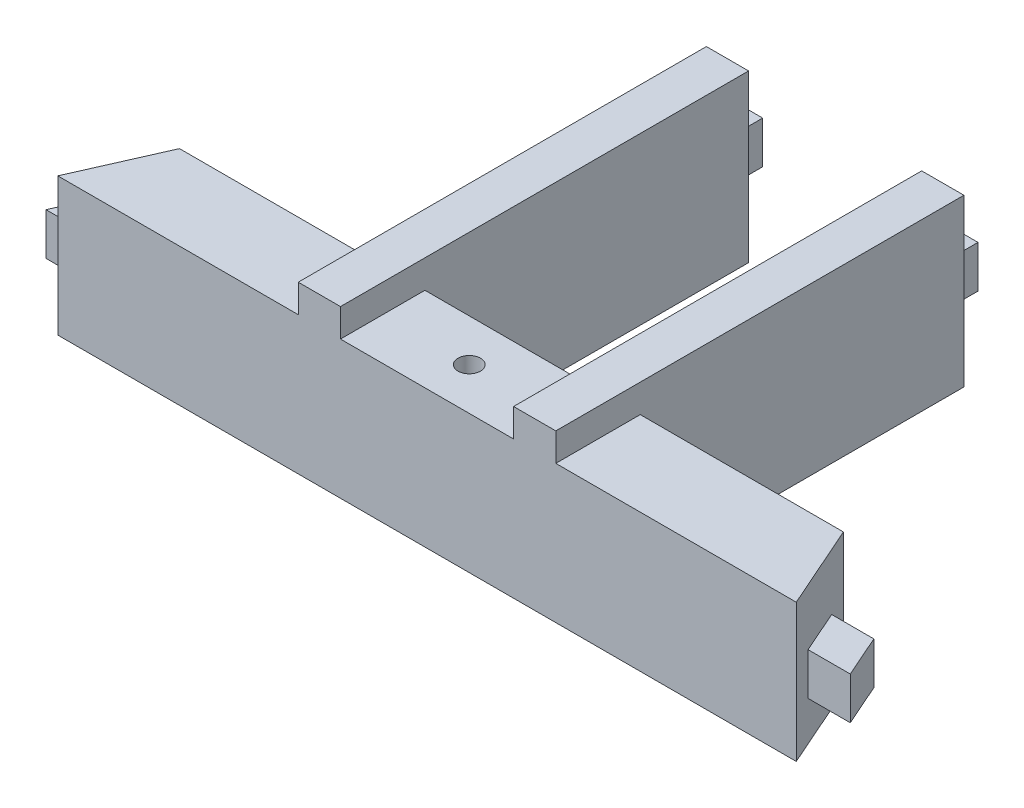
ISO-10303-21;
HEADER;
FILE_DESCRIPTION(('STEP AP214'),'2;1');
FILE_NAME('part.step','',(''),(''),'','','');
FILE_SCHEMA(('AUTOMOTIVE_DESIGN { 1 0 10303 214 1 1 1 1 }'));
ENDSEC;
DATA;
#1=APPLICATION_CONTEXT('core data for automotive mechanical design processes');
#2=APPLICATION_PROTOCOL_DEFINITION('international standard','automotive_design',2000,#1);
#3=PRODUCT_CONTEXT('',#1,'mechanical');
#4=PRODUCT('Part','Part','',(#3));
#5=PRODUCT_RELATED_PRODUCT_CATEGORY('part','',(#4));
#6=PRODUCT_DEFINITION_FORMATION('','',#4);
#7=PRODUCT_DEFINITION_CONTEXT('part definition',#1,'design');
#8=PRODUCT_DEFINITION('design','',#6,#7);
#9=PRODUCT_DEFINITION_SHAPE('','',#8);
#10=(LENGTH_UNIT() NAMED_UNIT(*) SI_UNIT(.MILLI.,.METRE.));
#11=(NAMED_UNIT(*) PLANE_ANGLE_UNIT() SI_UNIT($,.RADIAN.));
#12=(NAMED_UNIT(*) SI_UNIT($,.STERADIAN.) SOLID_ANGLE_UNIT());
#13=UNCERTAINTY_MEASURE_WITH_UNIT(LENGTH_MEASURE(1.E-05),#10,'distance_accuracy_value','');
#14=(GEOMETRIC_REPRESENTATION_CONTEXT(3) GLOBAL_UNCERTAINTY_ASSIGNED_CONTEXT((#13)) GLOBAL_UNIT_ASSIGNED_CONTEXT((#10,
#11,#12)) REPRESENTATION_CONTEXT('',''));
#15=CARTESIAN_POINT('',(0.,0.,0.));
#16=DIRECTION('',(0.,0.,1.));
#17=DIRECTION('',(1.,0.,0.));
#18=AXIS2_PLACEMENT_3D('',#15,#16,#17);
#19=CARTESIAN_POINT('',(-8.,23.,-72.5));
#20=DIRECTION('',(0.,0.,1.));
#21=DIRECTION('',(1.,0.,0.));
#22=AXIS2_PLACEMENT_3D('',#19,#20,#21);
#23=PLANE('',#22);
#24=DIRECTION('',(0.,1.,0.));
#25=VECTOR('',#24,1.);
#26=CARTESIAN_POINT('',(-9.15,-39.75283638214,-72.5));
#27=LINE('',#26,#25);
#28=CARTESIAN_POINT('',(-9.15,20.2,-72.5));
#29=VERTEX_POINT('',#28);
#30=CARTESIAN_POINT('',(-9.15,32.,-72.5));
#31=VERTEX_POINT('',#30);
#32=EDGE_CURVE('E576',#29,#31,#27,.T.);
#33=ORIENTED_EDGE('',*,*,#32,.T.);
#34=DIRECTION('',(1.,0.,0.));
#35=VECTOR('',#34,1.);
#36=CARTESIAN_POINT('',(13.4420338202135,32.,-72.5));
#37=LINE('',#36,#35);
#38=CARTESIAN_POINT('',(-6.15,32.,-72.5));
#39=VERTEX_POINT('',#38);
#40=EDGE_CURVE('E474',#31,#39,#37,.T.);
#41=ORIENTED_EDGE('',*,*,#40,.T.);
#42=DIRECTION('',(0.,1.,0.));
#43=VECTOR('',#42,1.);
#44=CARTESIAN_POINT('',(-6.15,-39.75283638214,-72.5));
#45=LINE('',#44,#43);
#46=CARTESIAN_POINT('',(-6.15,20.2,-72.5));
#47=VERTEX_POINT('',#46);
#48=EDGE_CURVE('E574',#47,#39,#45,.T.);
#49=ORIENTED_EDGE('',*,*,#48,.F.);
#50=DIRECTION('',(1.,0.,0.));
#51=VECTOR('',#50,1.);
#52=CARTESIAN_POINT('',(0.,20.2,-72.5));
#53=LINE('',#52,#51);
#54=EDGE_CURVE('E532',#29,#47,#53,.T.);
#55=ORIENTED_EDGE('',*,*,#54,.F.);
#56=EDGE_LOOP('',(#33,#41,#49,#55));
#57=FACE_BOUND('',#56,.T.);
#58=DIRECTION('',(0.,1.,0.));
#59=VECTOR('',#58,1.);
#60=CARTESIAN_POINT('',(-8.15,27.6,-72.5));
#61=LINE('',#60,#59);
#62=CARTESIAN_POINT('',(-8.15,24.6,-72.5));
#63=VERTEX_POINT('',#62);
#64=CARTESIAN_POINT('',(-8.15,27.6,-72.5));
#65=VERTEX_POINT('',#64);
#66=EDGE_CURVE('E372',#63,#65,#61,.T.);
#67=ORIENTED_EDGE('',*,*,#66,.F.);
#68=DIRECTION('',(-1.,0.,0.));
#69=VECTOR('',#68,1.);
#70=CARTESIAN_POINT('',(-8.15,24.6,-72.5));
#71=LINE('',#70,#69);
#72=CARTESIAN_POINT('',(-7.15,24.6,-72.5));
#73=VERTEX_POINT('',#72);
#74=EDGE_CURVE('E369',#73,#63,#71,.T.);
#75=ORIENTED_EDGE('',*,*,#74,.F.);
#76=DIRECTION('',(0.,-1.,0.));
#77=VECTOR('',#76,1.);
#78=CARTESIAN_POINT('',(-7.15,27.6,-72.5));
#79=LINE('',#78,#77);
#80=CARTESIAN_POINT('',(-7.15,27.6,-72.5));
#81=VERTEX_POINT('',#80);
#82=EDGE_CURVE('E164',#81,#73,#79,.T.);
#83=ORIENTED_EDGE('',*,*,#82,.F.);
#84=DIRECTION('',(1.,0.,0.));
#85=VECTOR('',#84,1.);
#86=CARTESIAN_POINT('',(-8.15,27.6,-72.5));
#87=LINE('',#86,#85);
#88=EDGE_CURVE('E159',#65,#81,#87,.T.);
#89=ORIENTED_EDGE('',*,*,#88,.F.);
#90=EDGE_LOOP('',(#67,#75,#83,#89));
#91=FACE_BOUND('',#90,.T.);
#92=ADVANCED_FACE('F144',(#57,#91),#23,.F.);
#93=CARTESIAN_POINT('',(1.84883014201315E-13,23.,-72.5));
#94=DIRECTION('',(0.,0.,-1.));
#95=DIRECTION('',(-1.,0.,0.));
#96=AXIS2_PLACEMENT_3D('',#93,#94,#95);
#97=PLANE('',#96);
#98=CARTESIAN_POINT('',(6.15,32.,-72.5));
#99=VERTEX_POINT('',#98);
#100=CARTESIAN_POINT('',(9.15000000000001,32.,-72.5));
#101=VERTEX_POINT('',#100);
#102=EDGE_CURVE('E465',#99,#101,#37,.T.);
#103=ORIENTED_EDGE('',*,*,#102,.T.);
#104=DIRECTION('',(0.,1.,0.));
#105=VECTOR('',#104,1.);
#106=CARTESIAN_POINT('',(9.15,-39.75283638214,-72.5));
#107=LINE('',#106,#105);
#108=CARTESIAN_POINT('',(9.15,20.2,-72.5));
#109=VERTEX_POINT('',#108);
#110=EDGE_CURVE('E565',#109,#101,#107,.T.);
#111=ORIENTED_EDGE('',*,*,#110,.F.);
#112=DIRECTION('',(1.,0.,0.));
#113=VECTOR('',#112,1.);
#114=CARTESIAN_POINT('',(0.,20.2,-72.5));
#115=LINE('',#114,#113);
#116=CARTESIAN_POINT('',(6.15,20.2,-72.5));
#117=VERTEX_POINT('',#116);
#118=EDGE_CURVE('E13',#117,#109,#115,.T.);
#119=ORIENTED_EDGE('',*,*,#118,.F.);
#120=DIRECTION('',(0.,1.,0.));
#121=VECTOR('',#120,1.);
#122=CARTESIAN_POINT('',(6.15,-39.75283638214,-72.5));
#123=LINE('',#122,#121);
#124=EDGE_CURVE('E567',#117,#99,#123,.T.);
#125=ORIENTED_EDGE('',*,*,#124,.T.);
#126=EDGE_LOOP('',(#103,#111,#119,#125));
#127=FACE_BOUND('',#126,.T.);
#128=DIRECTION('',(1.,0.,0.));
#129=VECTOR('',#128,1.);
#130=CARTESIAN_POINT('',(8.15,27.6,-72.5));
#131=LINE('',#130,#129);
#132=CARTESIAN_POINT('',(7.15,27.6,-72.5));
#133=VERTEX_POINT('',#132);
#134=CARTESIAN_POINT('',(8.15,27.6,-72.5));
#135=VERTEX_POINT('',#134);
#136=EDGE_CURVE('E376',#133,#135,#131,.T.);
#137=ORIENTED_EDGE('',*,*,#136,.F.);
#138=DIRECTION('',(0.,1.,0.));
#139=VECTOR('',#138,1.);
#140=CARTESIAN_POINT('',(7.15,27.6,-72.5));
#141=LINE('',#140,#139);
#142=CARTESIAN_POINT('',(7.15,24.6,-72.5));
#143=VERTEX_POINT('',#142);
#144=EDGE_CURVE('E373',#143,#133,#141,.T.);
#145=ORIENTED_EDGE('',*,*,#144,.F.);
#146=DIRECTION('',(-1.,0.,0.));
#147=VECTOR('',#146,1.);
#148=CARTESIAN_POINT('',(8.15,24.6,-72.5));
#149=LINE('',#148,#147);
#150=CARTESIAN_POINT('',(8.15,24.6,-72.5));
#151=VERTEX_POINT('',#150);
#152=EDGE_CURVE('E386',#151,#143,#149,.T.);
#153=ORIENTED_EDGE('',*,*,#152,.F.);
#154=DIRECTION('',(0.,-1.,0.));
#155=VECTOR('',#154,1.);
#156=CARTESIAN_POINT('',(8.15,27.6,-72.5));
#157=LINE('',#156,#155);
#158=EDGE_CURVE('E394',#135,#151,#157,.T.);
#159=ORIENTED_EDGE('',*,*,#158,.F.);
#160=EDGE_LOOP('',(#137,#145,#153,#159));
#161=FACE_BOUND('',#160,.T.);
#162=ADVANCED_FACE('F614',(#127,#161),#97,.T.);
#163=CARTESIAN_POINT('',(-13.4420338202134,23.,-72.5));
#164=DIRECTION('',(0.914917801572932,0.,0.403640206576294));
#165=DIRECTION('',(0.403640206576294,0.,-0.914917801572932));
#166=AXIS2_PLACEMENT_3D('',#163,#164,#165);
#167=PLANE('',#166);
#168=DIRECTION('',(0.,1.,0.));
#169=VECTOR('',#168,1.);
#170=CARTESIAN_POINT('',(-26.2361514672722,-39.75283638214,-43.5));
#171=LINE('',#170,#169);
#172=CARTESIAN_POINT('',(-26.2361514672722,20.2,-43.5));
#173=VERTEX_POINT('',#172);
#174=CARTESIAN_POINT('',(-26.2361514672722,30.,-43.5));
#175=VERTEX_POINT('',#174);
#176=EDGE_CURVE('E583',#173,#175,#171,.T.);
#177=ORIENTED_EDGE('',*,*,#176,.T.);
#178=DIRECTION('',(-0.403640206576294,0.,0.914917801572932));
#179=VECTOR('',#178,1.);
#180=CARTESIAN_POINT('',(-38.0260616192373,30.,-16.7762036555459));
#181=LINE('',#180,#179);
#182=CARTESIAN_POINT('',(-23.5890926437428,30.,-49.5));
#183=VERTEX_POINT('',#182);
#184=EDGE_CURVE('E478',#183,#175,#181,.T.);
#185=ORIENTED_EDGE('',*,*,#184,.F.);
#186=DIRECTION('',(0.,1.,0.));
#187=VECTOR('',#186,1.);
#188=CARTESIAN_POINT('',(-23.5890926437428,-39.75283638214,-49.5));
#189=LINE('',#188,#187);
#190=CARTESIAN_POINT('',(-23.5890926437428,20.2,-49.5));
#191=VERTEX_POINT('',#190);
#192=EDGE_CURVE('E581',#191,#183,#189,.T.);
#193=ORIENTED_EDGE('',*,*,#192,.F.);
#194=DIRECTION('',(0.403640206576293,0.,-0.914917801572932));
#195=VECTOR('',#194,1.);
#196=CARTESIAN_POINT('',(-38.0260616192373,20.2,-16.7762036555459));
#197=LINE('',#196,#195);
#198=EDGE_CURVE('E540',#173,#191,#197,.T.);
#199=ORIENTED_EDGE('',*,*,#198,.F.);
#200=EDGE_LOOP('',(#177,#185,#193,#199));
#201=FACE_BOUND('',#200,.T.);
#202=DIRECTION('',(-0.403640206576294,0.,0.914917801572932));
#203=VECTOR('',#202,1.);
#204=CARTESIAN_POINT('',(-25.5743867613899,23.,-45.));
#205=LINE('',#204,#203);
#206=CARTESIAN_POINT('',(-24.2508573496252,23.,-48.));
#207=VERTEX_POINT('',#206);
#208=CARTESIAN_POINT('',(-25.5743867613899,23.,-45.));
#209=VERTEX_POINT('',#208);
#210=EDGE_CURVE('E433',#207,#209,#205,.T.);
#211=ORIENTED_EDGE('',*,*,#210,.F.);
#212=DIRECTION('',(0.,-1.,0.));
#213=VECTOR('',#212,1.);
#214=CARTESIAN_POINT('',(-24.2508573496252,26.,-48.));
#215=LINE('',#214,#213);
#216=CARTESIAN_POINT('',(-24.2508573496252,26.,-48.));
#217=VERTEX_POINT('',#216);
#218=EDGE_CURVE('E463',#217,#207,#215,.T.);
#219=ORIENTED_EDGE('',*,*,#218,.F.);
#220=DIRECTION('',(-0.403640206576294,0.,0.914917801572932));
#221=VECTOR('',#220,1.);
#222=CARTESIAN_POINT('',(-25.5743867613899,26.,-45.));
#223=LINE('',#222,#221);
#224=CARTESIAN_POINT('',(-25.5743867613899,26.,-45.));
#225=VERTEX_POINT('',#224);
#226=EDGE_CURVE('E440',#217,#225,#223,.T.);
#227=ORIENTED_EDGE('',*,*,#226,.T.);
#228=DIRECTION('',(0.,-1.,0.));
#229=VECTOR('',#228,1.);
#230=CARTESIAN_POINT('',(-25.5743867613899,26.,-45.));
#231=LINE('',#230,#229);
#232=EDGE_CURVE('E453',#225,#209,#231,.T.);
#233=ORIENTED_EDGE('',*,*,#232,.T.);
#234=EDGE_LOOP('',(#211,#219,#227,#233));
#235=FACE_BOUND('',#234,.T.);
#236=ADVANCED_FACE('F654',(#201,#235),#167,.F.);
#237=CARTESIAN_POINT('',(0.,30.,0.));
#238=DIRECTION('',(0.,1.,0.));
#239=DIRECTION('',(0.,0.,1.));
#240=AXIS2_PLACEMENT_3D('',#237,#238,#239);
#241=PLANE('',#240);
#242=DIRECTION('',(1.,0.,0.));
#243=VECTOR('',#242,1.);
#244=CARTESIAN_POINT('',(0.,30.,-49.5));
#245=LINE('',#244,#243);
#246=CARTESIAN_POINT('',(-9.15,30.,-49.5));
#247=VERTEX_POINT('',#246);
#248=EDGE_CURVE('E558',#183,#247,#245,.T.);
#249=ORIENTED_EDGE('',*,*,#248,.F.);
#250=ORIENTED_EDGE('',*,*,#184,.T.);
#251=DIRECTION('',(1.,0.,0.));
#252=VECTOR('',#251,1.);
#253=CARTESIAN_POINT('',(0.,30.,-43.5));
#254=LINE('',#253,#252);
#255=CARTESIAN_POINT('',(-9.15,30.,-43.5));
#256=VERTEX_POINT('',#255);
#257=EDGE_CURVE('E556',#175,#256,#254,.T.);
#258=ORIENTED_EDGE('',*,*,#257,.T.);
#259=DIRECTION('',(0.,0.,1.));
#260=VECTOR('',#259,1.);
#261=CARTESIAN_POINT('',(-9.15,30.,-78.5));
#262=LINE('',#261,#260);
#263=EDGE_CURVE('E502',#247,#256,#262,.T.);
#264=ORIENTED_EDGE('',*,*,#263,.F.);
#265=EDGE_LOOP('',(#249,#250,#258,#264));
#266=FACE_BOUND('',#265,.T.);
#267=ADVANCED_FACE('F651',(#266),#241,.T.);
#268=CARTESIAN_POINT('',(9.15000000000001,30.,-43.5));
#269=VERTEX_POINT('',#268);
#270=CARTESIAN_POINT('',(26.2361514672722,30.,-43.5));
#271=VERTEX_POINT('',#270);
#272=EDGE_CURVE('E555',#269,#271,#254,.T.);
#273=ORIENTED_EDGE('',*,*,#272,.T.);
#274=DIRECTION('',(-0.403640206576291,0.,-0.914917801572933));
#275=VECTOR('',#274,1.);
#276=CARTESIAN_POINT('',(38.0260616192373,30.,-16.7762036555457));
#277=LINE('',#276,#275);
#278=CARTESIAN_POINT('',(23.5890926437428,30.,-49.5));
#279=VERTEX_POINT('',#278);
#280=EDGE_CURVE('E475',#271,#279,#277,.T.);
#281=ORIENTED_EDGE('',*,*,#280,.T.);
#282=DIRECTION('',(1.,0.,0.));
#283=VECTOR('',#282,1.);
#284=CARTESIAN_POINT('',(0.,30.,-49.5));
#285=LINE('',#284,#283);
#286=CARTESIAN_POINT('',(9.15000000000001,30.,-49.5));
#287=VERTEX_POINT('',#286);
#288=EDGE_CURVE('E522',#287,#279,#285,.T.);
#289=ORIENTED_EDGE('',*,*,#288,.F.);
#290=DIRECTION('',(0.,0.,-1.));
#291=VECTOR('',#290,1.);
#292=CARTESIAN_POINT('',(9.15,30.,-78.5));
#293=LINE('',#292,#291);
#294=EDGE_CURVE('E485',#269,#287,#293,.T.);
#295=ORIENTED_EDGE('',*,*,#294,.F.);
#296=EDGE_LOOP('',(#273,#281,#289,#295));
#297=FACE_BOUND('',#296,.T.);
#298=ADVANCED_FACE('F600',(#297),#241,.T.);
#299=CARTESIAN_POINT('',(9.15000000000001,-39.75283638214,0.));
#300=DIRECTION('',(1.,0.,0.));
#301=DIRECTION('',(0.,0.,-1.));
#302=AXIS2_PLACEMENT_3D('',#299,#300,#301);
#303=PLANE('',#302);
#304=ORIENTED_EDGE('',*,*,#110,.T.);
#305=DIRECTION('',(0.,0.,-1.));
#306=VECTOR('',#305,1.);
#307=CARTESIAN_POINT('',(9.15,32.,-78.5));
#308=LINE('',#307,#306);
#309=CARTESIAN_POINT('',(9.15000000000001,32.,-43.5));
#310=VERTEX_POINT('',#309);
#311=EDGE_CURVE('E487',#310,#101,#308,.T.);
#312=ORIENTED_EDGE('',*,*,#311,.F.);
#313=DIRECTION('',(0.,-1.,0.));
#314=VECTOR('',#313,1.);
#315=CARTESIAN_POINT('',(9.15000000000001,32.,-43.5));
#316=LINE('',#315,#314);
#317=EDGE_CURVE('E490',#310,#269,#316,.T.);
#318=ORIENTED_EDGE('',*,*,#317,.T.);
#319=ORIENTED_EDGE('',*,*,#294,.T.);
#320=DIRECTION('',(0.,1.,0.));
#321=VECTOR('',#320,1.);
#322=CARTESIAN_POINT('',(9.15,-39.75283638214,-49.5));
#323=LINE('',#322,#321);
#324=CARTESIAN_POINT('',(9.15,20.2,-49.5));
#325=VERTEX_POINT('',#324);
#326=EDGE_CURVE('E527',#325,#287,#323,.T.);
#327=ORIENTED_EDGE('',*,*,#326,.F.);
#328=DIRECTION('',(0.,0.,1.));
#329=VECTOR('',#328,1.);
#330=CARTESIAN_POINT('',(9.15000000000001,20.2,0.));
#331=LINE('',#330,#329);
#332=EDGE_CURVE('E152',#109,#325,#331,.T.);
#333=ORIENTED_EDGE('',*,*,#332,.F.);
#334=EDGE_LOOP('',(#304,#312,#318,#319,#327,#333));
#335=FACE_BOUND('',#334,.T.);
#336=ADVANCED_FACE('F610',(#335),#303,.T.);
#337=CARTESIAN_POINT('',(-9.15000000000001,-39.75283638214,0.));
#338=DIRECTION('',(1.,0.,0.));
#339=DIRECTION('',(0.,0.,-1.));
#340=AXIS2_PLACEMENT_3D('',#337,#338,#339);
#341=PLANE('',#340);
#342=DIRECTION('',(0.,0.,1.));
#343=VECTOR('',#342,1.);
#344=CARTESIAN_POINT('',(-9.15,32.,-78.5));
#345=LINE('',#344,#343);
#346=CARTESIAN_POINT('',(-9.15,32.,-43.5));
#347=VERTEX_POINT('',#346);
#348=EDGE_CURVE('E501',#31,#347,#345,.T.);
#349=ORIENTED_EDGE('',*,*,#348,.F.);
#350=ORIENTED_EDGE('',*,*,#32,.F.);
#351=DIRECTION('',(0.,0.,1.));
#352=VECTOR('',#351,1.);
#353=CARTESIAN_POINT('',(-9.15000000000001,20.2,0.));
#354=LINE('',#353,#352);
#355=CARTESIAN_POINT('',(-9.15,20.2,-49.5));
#356=VERTEX_POINT('',#355);
#357=EDGE_CURVE('E534',#29,#356,#354,.T.);
#358=ORIENTED_EDGE('',*,*,#357,.T.);
#359=DIRECTION('',(0.,1.,0.));
#360=VECTOR('',#359,1.);
#361=CARTESIAN_POINT('',(-9.15,-39.75283638214,-49.5));
#362=LINE('',#361,#360);
#363=EDGE_CURVE('E578',#356,#247,#362,.T.);
#364=ORIENTED_EDGE('',*,*,#363,.T.);
#365=ORIENTED_EDGE('',*,*,#263,.T.);
#366=DIRECTION('',(0.,-1.,0.));
#367=VECTOR('',#366,1.);
#368=CARTESIAN_POINT('',(-9.15,32.,-43.5));
#369=LINE('',#368,#367);
#370=EDGE_CURVE('E513',#347,#256,#369,.T.);
#371=ORIENTED_EDGE('',*,*,#370,.F.);
#372=EDGE_LOOP('',(#349,#350,#358,#364,#365,#371));
#373=FACE_BOUND('',#372,.T.);
#374=ADVANCED_FACE('F646',(#373),#341,.F.);
#375=CARTESIAN_POINT('',(-6.15,-39.75283638214,0.));
#376=DIRECTION('',(1.,0.,0.));
#377=DIRECTION('',(0.,0.,-1.));
#378=AXIS2_PLACEMENT_3D('',#375,#376,#377);
#379=PLANE('',#378);
#380=ORIENTED_EDGE('',*,*,#48,.T.);
#381=DIRECTION('',(0.,0.,-1.));
#382=VECTOR('',#381,1.);
#383=CARTESIAN_POINT('',(-6.15,32.,-78.5));
#384=LINE('',#383,#382);
#385=CARTESIAN_POINT('',(-6.15,32.,-43.5));
#386=VERTEX_POINT('',#385);
#387=EDGE_CURVE('E498',#386,#39,#384,.T.);
#388=ORIENTED_EDGE('',*,*,#387,.F.);
#389=DIRECTION('',(0.,-1.,0.));
#390=VECTOR('',#389,1.);
#391=CARTESIAN_POINT('',(-6.15,32.,-43.5));
#392=LINE('',#391,#390);
#393=CARTESIAN_POINT('',(-6.15,30.,-43.5));
#394=VERTEX_POINT('',#393);
#395=EDGE_CURVE('E506',#386,#394,#392,.T.);
#396=ORIENTED_EDGE('',*,*,#395,.T.);
#397=DIRECTION('',(0.,0.,-1.));
#398=VECTOR('',#397,1.);
#399=CARTESIAN_POINT('',(-6.15,30.,-78.5));
#400=LINE('',#399,#398);
#401=CARTESIAN_POINT('',(-6.15,30.,-49.5));
#402=VERTEX_POINT('',#401);
#403=EDGE_CURVE('E497',#394,#402,#400,.T.);
#404=ORIENTED_EDGE('',*,*,#403,.T.);
#405=DIRECTION('',(0.,1.,0.));
#406=VECTOR('',#405,1.);
#407=CARTESIAN_POINT('',(-6.15,-39.75283638214,-49.5));
#408=LINE('',#407,#406);
#409=CARTESIAN_POINT('',(-6.15,20.2,-49.5));
#410=VERTEX_POINT('',#409);
#411=EDGE_CURVE('E572',#410,#402,#408,.T.);
#412=ORIENTED_EDGE('',*,*,#411,.F.);
#413=DIRECTION('',(0.,0.,1.));
#414=VECTOR('',#413,1.);
#415=CARTESIAN_POINT('',(-6.15,20.2,0.));
#416=LINE('',#415,#414);
#417=EDGE_CURVE('E530',#47,#410,#416,.T.);
#418=ORIENTED_EDGE('',*,*,#417,.F.);
#419=EDGE_LOOP('',(#380,#388,#396,#404,#412,#418));
#420=FACE_BOUND('',#419,.T.);
#421=ADVANCED_FACE('F633',(#420),#379,.T.);
#422=CARTESIAN_POINT('',(6.15,-39.75283638214,0.));
#423=DIRECTION('',(1.,0.,0.));
#424=DIRECTION('',(0.,0.,-1.));
#425=AXIS2_PLACEMENT_3D('',#422,#423,#424);
#426=PLANE('',#425);
#427=DIRECTION('',(0.,0.,1.));
#428=VECTOR('',#427,1.);
#429=CARTESIAN_POINT('',(6.15,32.,-78.5));
#430=LINE('',#429,#428);
#431=CARTESIAN_POINT('',(6.15,32.,-43.5));
#432=VERTEX_POINT('',#431);
#433=EDGE_CURVE('E482',#99,#432,#430,.T.);
#434=ORIENTED_EDGE('',*,*,#433,.F.);
#435=ORIENTED_EDGE('',*,*,#124,.F.);
#436=DIRECTION('',(0.,0.,1.));
#437=VECTOR('',#436,1.);
#438=CARTESIAN_POINT('',(6.15,20.2,0.));
#439=LINE('',#438,#437);
#440=CARTESIAN_POINT('',(6.15,20.2,-49.5));
#441=VERTEX_POINT('',#440);
#442=EDGE_CURVE('E523',#117,#441,#439,.T.);
#443=ORIENTED_EDGE('',*,*,#442,.T.);
#444=DIRECTION('',(0.,1.,0.));
#445=VECTOR('',#444,1.);
#446=CARTESIAN_POINT('',(6.15,-39.75283638214,-49.5));
#447=LINE('',#446,#445);
#448=CARTESIAN_POINT('',(6.15,30.,-49.5));
#449=VERTEX_POINT('',#448);
#450=EDGE_CURVE('E569',#441,#449,#447,.T.);
#451=ORIENTED_EDGE('',*,*,#450,.T.);
#452=DIRECTION('',(0.,0.,1.));
#453=VECTOR('',#452,1.);
#454=CARTESIAN_POINT('',(6.15,30.,-78.5));
#455=LINE('',#454,#453);
#456=CARTESIAN_POINT('',(6.15,30.,-43.5));
#457=VERTEX_POINT('',#456);
#458=EDGE_CURVE('E481',#449,#457,#455,.T.);
#459=ORIENTED_EDGE('',*,*,#458,.T.);
#460=DIRECTION('',(0.,-1.,0.));
#461=VECTOR('',#460,1.);
#462=CARTESIAN_POINT('',(6.15,32.,-43.5));
#463=LINE('',#462,#461);
#464=EDGE_CURVE('E494',#432,#457,#463,.T.);
#465=ORIENTED_EDGE('',*,*,#464,.F.);
#466=EDGE_LOOP('',(#434,#435,#443,#451,#459,#465));
#467=FACE_BOUND('',#466,.T.);
#468=ADVANCED_FACE('F694',(#467),#426,.F.);
#469=CARTESIAN_POINT('',(0.,32.,0.));
#470=DIRECTION('',(0.,-1.,0.));
#471=DIRECTION('',(0.,0.,-1.));
#472=AXIS2_PLACEMENT_3D('',#469,#470,#471);
#473=PLANE('',#472);
#474=ORIENTED_EDGE('',*,*,#40,.F.);
#475=ORIENTED_EDGE('',*,*,#348,.T.);
#476=DIRECTION('',(1.,0.,0.));
#477=VECTOR('',#476,1.);
#478=CARTESIAN_POINT('',(-6.15,32.,-43.5));
#479=LINE('',#478,#477);
#480=EDGE_CURVE('E504',#347,#386,#479,.T.);
#481=ORIENTED_EDGE('',*,*,#480,.T.);
#482=ORIENTED_EDGE('',*,*,#387,.T.);
#483=EDGE_LOOP('',(#474,#475,#481,#482));
#484=FACE_BOUND('',#483,.T.);
#485=ADVANCED_FACE('F640',(#484),#473,.F.);
#486=CARTESIAN_POINT('',(0.,32.,0.));
#487=DIRECTION('',(0.,1.,0.));
#488=DIRECTION('',(0.,0.,1.));
#489=AXIS2_PLACEMENT_3D('',#486,#487,#488);
#490=PLANE('',#489);
#491=ORIENTED_EDGE('',*,*,#311,.T.);
#492=ORIENTED_EDGE('',*,*,#102,.F.);
#493=ORIENTED_EDGE('',*,*,#433,.T.);
#494=DIRECTION('',(1.,0.,0.));
#495=VECTOR('',#494,1.);
#496=CARTESIAN_POINT('',(6.15,32.,-43.5));
#497=LINE('',#496,#495);
#498=EDGE_CURVE('E484',#432,#310,#497,.T.);
#499=ORIENTED_EDGE('',*,*,#498,.T.);
#500=EDGE_LOOP('',(#491,#492,#493,#499));
#501=FACE_BOUND('',#500,.T.);
#502=ADVANCED_FACE('F619',(#501),#490,.T.);
#503=CARTESIAN_POINT('',(0.,30.,-46.5000000000032));
#504=DIRECTION('',(0.,1.,0.));
#505=DIRECTION('',(0.,0.,1.));
#506=AXIS2_PLACEMENT_3D('',#503,#504,#505);
#507=CIRCLE('',#506,0.800000000000938);
#508=CARTESIAN_POINT('',(0.,30.,-45.7000000000023));
#509=VERTEX_POINT('',#508);
#510=EDGE_CURVE('E519',#509,#509,#507,.T.);
#511=ORIENTED_EDGE('',*,*,#510,.F.);
#512=EDGE_LOOP('',(#511));
#513=FACE_BOUND('',#512,.T.);
#514=EDGE_CURVE('E559',#394,#457,#254,.T.);
#515=ORIENTED_EDGE('',*,*,#514,.T.);
#516=ORIENTED_EDGE('',*,*,#458,.F.);
#517=DIRECTION('',(1.,0.,0.));
#518=VECTOR('',#517,1.);
#519=CARTESIAN_POINT('',(0.,30.,-49.5));
#520=LINE('',#519,#518);
#521=EDGE_CURVE('E562',#402,#449,#520,.T.);
#522=ORIENTED_EDGE('',*,*,#521,.F.);
#523=ORIENTED_EDGE('',*,*,#403,.F.);
#524=EDGE_LOOP('',(#515,#516,#522,#523));
#525=FACE_BOUND('',#524,.T.);
#526=ADVANCED_FACE('F146',(#513,#525),#241,.T.);
#527=CARTESIAN_POINT('',(0.,-39.75283638214,-49.5));
#528=DIRECTION('',(0.,0.,1.));
#529=DIRECTION('',(1.,0.,0.));
#530=AXIS2_PLACEMENT_3D('',#527,#528,#529);
#531=PLANE('',#530);
#532=DIRECTION('',(0.,1.,0.));
#533=VECTOR('',#532,1.);
#534=CARTESIAN_POINT('',(23.5890929023814,-39.75283638214,-49.5));
#535=LINE('',#534,#533);
#536=CARTESIAN_POINT('',(23.5890926437428,20.2,-49.5));
#537=VERTEX_POINT('',#536);
#538=EDGE_CURVE('E587',#537,#279,#535,.T.);
#539=ORIENTED_EDGE('',*,*,#538,.F.);
#540=DIRECTION('',(-1.,0.,0.));
#541=VECTOR('',#540,1.);
#542=CARTESIAN_POINT('',(0.,20.2,-49.5));
#543=LINE('',#542,#541);
#544=EDGE_CURVE('E549',#537,#325,#543,.T.);
#545=ORIENTED_EDGE('',*,*,#544,.T.);
#546=ORIENTED_EDGE('',*,*,#326,.T.);
#547=ORIENTED_EDGE('',*,*,#288,.T.);
#548=EDGE_LOOP('',(#539,#545,#546,#547));
#549=FACE_BOUND('',#548,.T.);
#550=ADVANCED_FACE('F593',(#549),#531,.F.);
#551=CARTESIAN_POINT('',(0.,-39.75283638214,-43.5));
#552=DIRECTION('',(0.,0.,1.));
#553=DIRECTION('',(1.,0.,0.));
#554=AXIS2_PLACEMENT_3D('',#551,#552,#553);
#555=PLANE('',#554);
#556=DIRECTION('',(-1.,0.,0.));
#557=VECTOR('',#556,1.);
#558=CARTESIAN_POINT('',(0.,20.2,-43.5));
#559=LINE('',#558,#557);
#560=CARTESIAN_POINT('',(26.2361514672722,20.2,-43.5));
#561=VERTEX_POINT('',#560);
#562=EDGE_CURVE('E543',#561,#173,#559,.T.);
#563=ORIENTED_EDGE('',*,*,#562,.F.);
#564=DIRECTION('',(0.,1.,0.));
#565=VECTOR('',#564,1.);
#566=CARTESIAN_POINT('',(26.236151610291,-39.75283638214,-43.5));
#567=LINE('',#566,#565);
#568=EDGE_CURVE('E585',#561,#271,#567,.T.);
#569=ORIENTED_EDGE('',*,*,#568,.T.);
#570=ORIENTED_EDGE('',*,*,#272,.F.);
#571=ORIENTED_EDGE('',*,*,#317,.F.);
#572=ORIENTED_EDGE('',*,*,#498,.F.);
#573=ORIENTED_EDGE('',*,*,#464,.T.);
#574=ORIENTED_EDGE('',*,*,#514,.F.);
#575=ORIENTED_EDGE('',*,*,#395,.F.);
#576=ORIENTED_EDGE('',*,*,#480,.F.);
#577=ORIENTED_EDGE('',*,*,#370,.T.);
#578=ORIENTED_EDGE('',*,*,#257,.F.);
#579=ORIENTED_EDGE('',*,*,#176,.F.);
#580=EDGE_LOOP('',(#563,#569,#570,#571,#572,#573,#574,#575,#576,#577,#578,#579));
#581=FACE_BOUND('',#580,.T.);
#582=ADVANCED_FACE('F624',(#581),#555,.T.);
#583=CARTESIAN_POINT('',(0.,-39.75283638214,-49.5));
#584=DIRECTION('',(0.,0.,1.));
#585=DIRECTION('',(1.,0.,0.));
#586=AXIS2_PLACEMENT_3D('',#583,#584,#585);
#587=PLANE('',#586);
#588=ORIENTED_EDGE('',*,*,#363,.F.);
#589=DIRECTION('',(-1.,0.,0.));
#590=VECTOR('',#589,1.);
#591=CARTESIAN_POINT('',(0.,20.2,-49.5));
#592=LINE('',#591,#590);
#593=EDGE_CURVE('E537',#356,#191,#592,.T.);
#594=ORIENTED_EDGE('',*,*,#593,.T.);
#595=ORIENTED_EDGE('',*,*,#192,.T.);
#596=ORIENTED_EDGE('',*,*,#248,.T.);
#597=EDGE_LOOP('',(#588,#594,#595,#596));
#598=FACE_BOUND('',#597,.T.);
#599=ADVANCED_FACE('F658',(#598),#587,.F.);
#600=CARTESIAN_POINT('',(0.,-39.75283638214,-49.5));
#601=DIRECTION('',(0.,0.,1.));
#602=DIRECTION('',(1.,0.,0.));
#603=AXIS2_PLACEMENT_3D('',#600,#601,#602);
#604=PLANE('',#603);
#605=ORIENTED_EDGE('',*,*,#450,.F.);
#606=DIRECTION('',(-1.,0.,0.));
#607=VECTOR('',#606,1.);
#608=CARTESIAN_POINT('',(0.,20.2,-49.5));
#609=LINE('',#608,#607);
#610=EDGE_CURVE('E526',#441,#410,#609,.T.);
#611=ORIENTED_EDGE('',*,*,#610,.T.);
#612=ORIENTED_EDGE('',*,*,#411,.T.);
#613=ORIENTED_EDGE('',*,*,#521,.T.);
#614=EDGE_LOOP('',(#605,#611,#612,#613));
#615=FACE_BOUND('',#614,.T.);
#616=ADVANCED_FACE('F660',(#615),#604,.F.);
#617=CARTESIAN_POINT('',(6.2,20.2,38.501));
#618=DIRECTION('',(0.,1.,0.));
#619=DIRECTION('',(0.,0.,1.));
#620=AXIS2_PLACEMENT_3D('',#617,#618,#619);
#621=PLANE('',#620);
#622=CARTESIAN_POINT('',(0.,20.2,-46.5000000000032));
#623=DIRECTION('',(0.,1.,0.));
#624=DIRECTION('',(0.,0.,1.));
#625=AXIS2_PLACEMENT_3D('',#622,#623,#624);
#626=CIRCLE('',#625,0.800000000000938);
#627=CARTESIAN_POINT('',(0.,20.2,-45.7000000000023));
#628=VERTEX_POINT('',#627);
#629=EDGE_CURVE('E516',#628,#628,#626,.F.);
#630=ORIENTED_EDGE('',*,*,#629,.F.);
#631=EDGE_LOOP('',(#630));
#632=FACE_BOUND('',#631,.T.);
#633=ORIENTED_EDGE('',*,*,#332,.T.);
#634=ORIENTED_EDGE('',*,*,#544,.F.);
#635=DIRECTION('',(0.403640191818294,0.,0.914917808083814));
#636=VECTOR('',#635,1.);
#637=CARTESIAN_POINT('',(38.0260615784959,20.2,-16.7762029048103));
#638=LINE('',#637,#636);
#639=EDGE_CURVE('E546',#537,#561,#638,.T.);
#640=ORIENTED_EDGE('',*,*,#639,.T.);
#641=ORIENTED_EDGE('',*,*,#562,.T.);
#642=ORIENTED_EDGE('',*,*,#198,.T.);
#643=ORIENTED_EDGE('',*,*,#593,.F.);
#644=ORIENTED_EDGE('',*,*,#357,.F.);
#645=ORIENTED_EDGE('',*,*,#54,.T.);
#646=ORIENTED_EDGE('',*,*,#417,.T.);
#647=ORIENTED_EDGE('',*,*,#610,.F.);
#648=ORIENTED_EDGE('',*,*,#442,.F.);
#649=ORIENTED_EDGE('',*,*,#118,.T.);
#650=EDGE_LOOP('',(#633,#634,#640,#641,#642,#643,#644,#645,#646,#647,#648,#649));
#651=FACE_BOUND('',#650,.T.);
#652=ADVANCED_FACE('F606',(#632,#651),#621,.F.);
#653=CARTESIAN_POINT('',(0.,-0.00110000000000388,-46.5000000000032));
#654=DIRECTION('',(0.,1.,0.));
#655=DIRECTION('',(0.,0.,1.));
#656=AXIS2_PLACEMENT_3D('',#653,#654,#655);
#657=CYLINDRICAL_SURFACE('',#656,0.800000000000938);
#658=ORIENTED_EDGE('',*,*,#510,.T.);
#659=EDGE_LOOP('',(#658));
#660=FACE_BOUND('',#659,.T.);
#661=ORIENTED_EDGE('',*,*,#629,.T.);
#662=EDGE_LOOP('',(#661));
#663=FACE_BOUND('',#662,.T.);
#664=ADVANCED_FACE('F687',(#660,#663),#657,.F.);
#665=CARTESIAN_POINT('',(38.0260616192373,23.,-16.7762036555457));
#666=DIRECTION('',(0.914917801572933,0.,-0.403640206576291));
#667=DIRECTION('',(-0.403640206576291,0.,-0.914917801572933));
#668=AXIS2_PLACEMENT_3D('',#665,#666,#667);
#669=PLANE('',#668);
#670=DIRECTION('',(-0.403640206576292,0.,-0.914917801572932));
#671=VECTOR('',#670,1.);
#672=CARTESIAN_POINT('',(25.5743867613899,23.,-45.));
#673=LINE('',#672,#671);
#674=CARTESIAN_POINT('',(25.5743867613899,23.,-45.));
#675=VERTEX_POINT('',#674);
#676=CARTESIAN_POINT('',(24.2508573496252,23.,-48.));
#677=VERTEX_POINT('',#676);
#678=EDGE_CURVE('E424',#675,#677,#673,.T.);
#679=ORIENTED_EDGE('',*,*,#678,.F.);
#680=DIRECTION('',(0.,-1.,0.));
#681=VECTOR('',#680,1.);
#682=CARTESIAN_POINT('',(25.5743867613899,26.,-45.));
#683=LINE('',#682,#681);
#684=CARTESIAN_POINT('',(25.5743867613899,26.,-45.));
#685=VERTEX_POINT('',#684);
#686=EDGE_CURVE('E421',#685,#675,#683,.T.);
#687=ORIENTED_EDGE('',*,*,#686,.F.);
#688=DIRECTION('',(-0.403640206576292,0.,-0.914917801572932));
#689=VECTOR('',#688,1.);
#690=CARTESIAN_POINT('',(25.5743867613899,26.,-45.));
#691=LINE('',#690,#689);
#692=CARTESIAN_POINT('',(24.2508573496252,26.,-48.));
#693=VERTEX_POINT('',#692);
#694=EDGE_CURVE('E411',#685,#693,#691,.T.);
#695=ORIENTED_EDGE('',*,*,#694,.T.);
#696=DIRECTION('',(0.,-1.,0.));
#697=VECTOR('',#696,1.);
#698=CARTESIAN_POINT('',(24.2508573496252,26.,-48.));
#699=LINE('',#698,#697);
#700=EDGE_CURVE('E436',#693,#677,#699,.T.);
#701=ORIENTED_EDGE('',*,*,#700,.T.);
#702=EDGE_LOOP('',(#679,#687,#695,#701));
#703=FACE_BOUND('',#702,.T.);
#704=ORIENTED_EDGE('',*,*,#538,.T.);
#705=ORIENTED_EDGE('',*,*,#280,.F.);
#706=ORIENTED_EDGE('',*,*,#568,.F.);
#707=ORIENTED_EDGE('',*,*,#639,.F.);
#708=EDGE_LOOP('',(#704,#705,#706,#707));
#709=FACE_BOUND('',#708,.T.);
#710=ADVANCED_FACE('F604',(#703,#709),#669,.T.);
#711=CARTESIAN_POINT('',(-27.2508573496252,26.,-48.));
#712=DIRECTION('',(0.,0.,-1.));
#713=DIRECTION('',(-1.,0.,0.));
#714=AXIS2_PLACEMENT_3D('',#711,#712,#713);
#715=PLANE('',#714);
#716=DIRECTION('',(1.,0.,0.));
#717=VECTOR('',#716,1.);
#718=CARTESIAN_POINT('',(-27.2508573496252,23.,-48.));
#719=LINE('',#718,#717);
#720=CARTESIAN_POINT('',(-27.2508573496252,23.,-48.));
#721=VERTEX_POINT('',#720);
#722=EDGE_CURVE('E444',#721,#207,#719,.T.);
#723=ORIENTED_EDGE('',*,*,#722,.F.);
#724=DIRECTION('',(0.,-1.,0.));
#725=VECTOR('',#724,1.);
#726=CARTESIAN_POINT('',(-27.2508573496252,26.,-48.));
#727=LINE('',#726,#725);
#728=CARTESIAN_POINT('',(-27.2508573496252,26.,-48.));
#729=VERTEX_POINT('',#728);
#730=EDGE_CURVE('E466',#729,#721,#727,.T.);
#731=ORIENTED_EDGE('',*,*,#730,.F.);
#732=DIRECTION('',(1.,0.,0.));
#733=VECTOR('',#732,1.);
#734=CARTESIAN_POINT('',(-27.2508573496252,26.,-48.));
#735=LINE('',#734,#733);
#736=EDGE_CURVE('E450',#729,#217,#735,.T.);
#737=ORIENTED_EDGE('',*,*,#736,.T.);
#738=ORIENTED_EDGE('',*,*,#218,.T.);
#739=EDGE_LOOP('',(#723,#731,#737,#738));
#740=FACE_BOUND('',#739,.T.);
#741=ADVANCED_FACE('F686',(#740),#715,.T.);
#742=CARTESIAN_POINT('',(-28.5743867613899,26.,-45.));
#743=DIRECTION('',(-0.914917801572931,0.,-0.403640206576295));
#744=DIRECTION('',(-0.403640206576295,0.,0.914917801572931));
#745=AXIS2_PLACEMENT_3D('',#742,#743,#744);
#746=PLANE('',#745);
#747=DIRECTION('',(0.403640206576295,0.,-0.914917801572931));
#748=VECTOR('',#747,1.);
#749=CARTESIAN_POINT('',(-28.5743867613899,23.,-45.));
#750=LINE('',#749,#748);
#751=CARTESIAN_POINT('',(-28.5743867613899,23.,-45.));
#752=VERTEX_POINT('',#751);
#753=EDGE_CURVE('E458',#752,#721,#750,.T.);
#754=ORIENTED_EDGE('',*,*,#753,.F.);
#755=DIRECTION('',(0.,-1.,0.));
#756=VECTOR('',#755,1.);
#757=CARTESIAN_POINT('',(-28.5743867613899,26.,-45.));
#758=LINE('',#757,#756);
#759=CARTESIAN_POINT('',(-28.5743867613899,26.,-45.));
#760=VERTEX_POINT('',#759);
#761=EDGE_CURVE('E468',#760,#752,#758,.T.);
#762=ORIENTED_EDGE('',*,*,#761,.F.);
#763=DIRECTION('',(0.403640206576295,0.,-0.914917801572931));
#764=VECTOR('',#763,1.);
#765=CARTESIAN_POINT('',(-28.5743867613899,26.,-45.));
#766=LINE('',#765,#764);
#767=EDGE_CURVE('E447',#760,#729,#766,.T.);
#768=ORIENTED_EDGE('',*,*,#767,.T.);
#769=ORIENTED_EDGE('',*,*,#730,.T.);
#770=EDGE_LOOP('',(#754,#762,#768,#769));
#771=FACE_BOUND('',#770,.T.);
#772=ADVANCED_FACE('F872',(#771),#746,.T.);
#773=CARTESIAN_POINT('',(-25.5743867613899,26.,-45.));
#774=DIRECTION('',(0.,0.,1.));
#775=DIRECTION('',(1.,0.,0.));
#776=AXIS2_PLACEMENT_3D('',#773,#774,#775);
#777=PLANE('',#776);
#778=DIRECTION('',(-1.,0.,0.));
#779=VECTOR('',#778,1.);
#780=CARTESIAN_POINT('',(-25.5743867613899,23.,-45.));
#781=LINE('',#780,#779);
#782=EDGE_CURVE('E455',#209,#752,#781,.T.);
#783=ORIENTED_EDGE('',*,*,#782,.F.);
#784=ORIENTED_EDGE('',*,*,#232,.F.);
#785=DIRECTION('',(-1.,0.,0.));
#786=VECTOR('',#785,1.);
#787=CARTESIAN_POINT('',(-25.5743867613899,26.,-45.));
#788=LINE('',#787,#786);
#789=EDGE_CURVE('E443',#225,#760,#788,.T.);
#790=ORIENTED_EDGE('',*,*,#789,.T.);
#791=ORIENTED_EDGE('',*,*,#761,.T.);
#792=EDGE_LOOP('',(#783,#784,#790,#791));
#793=FACE_BOUND('',#792,.T.);
#794=ADVANCED_FACE('F681',(#793),#777,.T.);
#795=CARTESIAN_POINT('',(0.,26.,0.));
#796=DIRECTION('',(0.,-1.,0.));
#797=DIRECTION('',(0.,0.,-1.));
#798=AXIS2_PLACEMENT_3D('',#795,#796,#797);
#799=PLANE('',#798);
#800=ORIENTED_EDGE('',*,*,#226,.F.);
#801=ORIENTED_EDGE('',*,*,#736,.F.);
#802=ORIENTED_EDGE('',*,*,#767,.F.);
#803=ORIENTED_EDGE('',*,*,#789,.F.);
#804=EDGE_LOOP('',(#800,#801,#802,#803));
#805=FACE_BOUND('',#804,.T.);
#806=ADVANCED_FACE('F888',(#805),#799,.F.);
#807=CARTESIAN_POINT('',(0.,23.,0.));
#808=DIRECTION('',(0.,-1.,0.));
#809=DIRECTION('',(0.,0.,-1.));
#810=AXIS2_PLACEMENT_3D('',#807,#808,#809);
#811=PLANE('',#810);
#812=ORIENTED_EDGE('',*,*,#210,.T.);
#813=ORIENTED_EDGE('',*,*,#782,.T.);
#814=ORIENTED_EDGE('',*,*,#753,.T.);
#815=ORIENTED_EDGE('',*,*,#722,.T.);
#816=EDGE_LOOP('',(#812,#813,#814,#815));
#817=FACE_BOUND('',#816,.T.);
#818=ADVANCED_FACE('F896',(#817),#811,.T.);
#819=CARTESIAN_POINT('',(25.5743867613899,26.,-45.));
#820=DIRECTION('',(0.,0.,1.));
#821=DIRECTION('',(1.,0.,0.));
#822=AXIS2_PLACEMENT_3D('',#819,#820,#821);
#823=PLANE('',#822);
#824=DIRECTION('',(-1.,0.,0.));
#825=VECTOR('',#824,1.);
#826=CARTESIAN_POINT('',(25.5743867613899,23.,-45.));
#827=LINE('',#826,#825);
#828=CARTESIAN_POINT('',(28.5743867613899,23.,-45.));
#829=VERTEX_POINT('',#828);
#830=EDGE_CURVE('E407',#829,#675,#827,.T.);
#831=ORIENTED_EDGE('',*,*,#830,.F.);
#832=DIRECTION('',(0.,-1.,0.));
#833=VECTOR('',#832,1.);
#834=CARTESIAN_POINT('',(28.5743867613899,26.,-45.));
#835=LINE('',#834,#833);
#836=CARTESIAN_POINT('',(28.5743867613899,26.,-45.));
#837=VERTEX_POINT('',#836);
#838=EDGE_CURVE('E431',#837,#829,#835,.T.);
#839=ORIENTED_EDGE('',*,*,#838,.F.);
#840=DIRECTION('',(-1.,0.,0.));
#841=VECTOR('',#840,1.);
#842=CARTESIAN_POINT('',(25.5743867613899,26.,-45.));
#843=LINE('',#842,#841);
#844=EDGE_CURVE('E408',#837,#685,#843,.T.);
#845=ORIENTED_EDGE('',*,*,#844,.T.);
#846=ORIENTED_EDGE('',*,*,#686,.T.);
#847=EDGE_LOOP('',(#831,#839,#845,#846));
#848=FACE_BOUND('',#847,.T.);
#849=ADVANCED_FACE('F905',(#848),#823,.T.);
#850=CARTESIAN_POINT('',(28.5743867613899,26.,-45.));
#851=DIRECTION('',(0.914917801572931,0.,-0.403640206576295));
#852=DIRECTION('',(-0.403640206576295,0.,-0.914917801572931));
#853=AXIS2_PLACEMENT_3D('',#850,#851,#852);
#854=PLANE('',#853);
#855=DIRECTION('',(0.403640206576295,0.,0.914917801572931));
#856=VECTOR('',#855,1.);
#857=CARTESIAN_POINT('',(28.5743867613899,23.,-45.));
#858=LINE('',#857,#856);
#859=CARTESIAN_POINT('',(27.2508573496252,23.,-48.));
#860=VERTEX_POINT('',#859);
#861=EDGE_CURVE('E412',#860,#829,#858,.T.);
#862=ORIENTED_EDGE('',*,*,#861,.F.);
#863=DIRECTION('',(0.,-1.,0.));
#864=VECTOR('',#863,1.);
#865=CARTESIAN_POINT('',(27.2508573496252,26.,-48.));
#866=LINE('',#865,#864);
#867=CARTESIAN_POINT('',(27.2508573496252,26.,-48.));
#868=VERTEX_POINT('',#867);
#869=EDGE_CURVE('E434',#868,#860,#866,.T.);
#870=ORIENTED_EDGE('',*,*,#869,.F.);
#871=DIRECTION('',(0.403640206576295,0.,0.914917801572931));
#872=VECTOR('',#871,1.);
#873=CARTESIAN_POINT('',(28.5743867613899,26.,-45.));
#874=LINE('',#873,#872);
#875=EDGE_CURVE('E418',#868,#837,#874,.T.);
#876=ORIENTED_EDGE('',*,*,#875,.T.);
#877=ORIENTED_EDGE('',*,*,#838,.T.);
#878=EDGE_LOOP('',(#862,#870,#876,#877));
#879=FACE_BOUND('',#878,.T.);
#880=ADVANCED_FACE('F914',(#879),#854,.T.);
#881=CARTESIAN_POINT('',(27.2508573496252,26.,-48.));
#882=DIRECTION('',(0.,0.,-1.));
#883=DIRECTION('',(-1.,0.,0.));
#884=AXIS2_PLACEMENT_3D('',#881,#882,#883);
#885=PLANE('',#884);
#886=DIRECTION('',(1.,0.,0.));
#887=VECTOR('',#886,1.);
#888=CARTESIAN_POINT('',(27.2508573496252,23.,-48.));
#889=LINE('',#888,#887);
#890=EDGE_CURVE('E426',#677,#860,#889,.T.);
#891=ORIENTED_EDGE('',*,*,#890,.F.);
#892=ORIENTED_EDGE('',*,*,#700,.F.);
#893=DIRECTION('',(1.,0.,0.));
#894=VECTOR('',#893,1.);
#895=CARTESIAN_POINT('',(27.2508573496252,26.,-48.));
#896=LINE('',#895,#894);
#897=EDGE_CURVE('E415',#693,#868,#896,.T.);
#898=ORIENTED_EDGE('',*,*,#897,.T.);
#899=ORIENTED_EDGE('',*,*,#869,.T.);
#900=EDGE_LOOP('',(#891,#892,#898,#899));
#901=FACE_BOUND('',#900,.T.);
#902=ADVANCED_FACE('F923',(#901),#885,.T.);
#903=CARTESIAN_POINT('',(0.,26.,0.));
#904=DIRECTION('',(0.,1.,0.));
#905=DIRECTION('',(0.,0.,1.));
#906=AXIS2_PLACEMENT_3D('',#903,#904,#905);
#907=PLANE('',#906);
#908=ORIENTED_EDGE('',*,*,#844,.F.);
#909=ORIENTED_EDGE('',*,*,#875,.F.);
#910=ORIENTED_EDGE('',*,*,#897,.F.);
#911=ORIENTED_EDGE('',*,*,#694,.F.);
#912=EDGE_LOOP('',(#908,#909,#910,#911));
#913=FACE_BOUND('',#912,.T.);
#914=ADVANCED_FACE('F932',(#913),#907,.T.);
#915=CARTESIAN_POINT('',(0.,23.,0.));
#916=DIRECTION('',(0.,1.,0.));
#917=DIRECTION('',(0.,0.,1.));
#918=AXIS2_PLACEMENT_3D('',#915,#916,#917);
#919=PLANE('',#918);
#920=ORIENTED_EDGE('',*,*,#830,.T.);
#921=ORIENTED_EDGE('',*,*,#678,.T.);
#922=ORIENTED_EDGE('',*,*,#890,.T.);
#923=ORIENTED_EDGE('',*,*,#861,.T.);
#924=EDGE_LOOP('',(#920,#921,#922,#923));
#925=FACE_BOUND('',#924,.T.);
#926=ADVANCED_FACE('F941',(#925),#919,.F.);
#927=CARTESIAN_POINT('',(7.15,27.6,-74.5));
#928=DIRECTION('',(1.,0.,0.));
#929=DIRECTION('',(0.,1.,0.));
#930=AXIS2_PLACEMENT_3D('',#927,#928,#929);
#931=PLANE('',#930);
#932=ORIENTED_EDGE('',*,*,#144,.T.);
#933=DIRECTION('',(0.,0.,1.));
#934=VECTOR('',#933,1.);
#935=CARTESIAN_POINT('',(7.15,27.6,-74.5));
#936=LINE('',#935,#934);
#937=CARTESIAN_POINT('',(7.15,27.6,-74.5));
#938=VERTEX_POINT('',#937);
#939=EDGE_CURVE('E405',#938,#133,#936,.T.);
#940=ORIENTED_EDGE('',*,*,#939,.F.);
#941=DIRECTION('',(0.,1.,0.));
#942=VECTOR('',#941,1.);
#943=CARTESIAN_POINT('',(7.15,27.6,-74.5));
#944=LINE('',#943,#942);
#945=CARTESIAN_POINT('',(7.15,24.6,-74.5));
#946=VERTEX_POINT('',#945);
#947=EDGE_CURVE('E382',#946,#938,#944,.T.);
#948=ORIENTED_EDGE('',*,*,#947,.F.);
#949=DIRECTION('',(0.,0.,1.));
#950=VECTOR('',#949,1.);
#951=CARTESIAN_POINT('',(7.15,24.6,-74.5));
#952=LINE('',#951,#950);
#953=EDGE_CURVE('E391',#946,#143,#952,.T.);
#954=ORIENTED_EDGE('',*,*,#953,.T.);
#955=EDGE_LOOP('',(#932,#940,#948,#954));
#956=FACE_BOUND('',#955,.T.);
#957=ADVANCED_FACE('F950',(#956),#931,.F.);
#958=CARTESIAN_POINT('',(8.15,27.6,-74.5));
#959=DIRECTION('',(0.,-1.,0.));
#960=DIRECTION('',(0.,0.,-1.));
#961=AXIS2_PLACEMENT_3D('',#958,#959,#960);
#962=PLANE('',#961);
#963=ORIENTED_EDGE('',*,*,#136,.T.);
#964=DIRECTION('',(0.,0.,1.));
#965=VECTOR('',#964,1.);
#966=CARTESIAN_POINT('',(8.15,27.6,-74.5));
#967=LINE('',#966,#965);
#968=CARTESIAN_POINT('',(8.15,27.6,-74.5));
#969=VERTEX_POINT('',#968);
#970=EDGE_CURVE('E402',#969,#135,#967,.T.);
#971=ORIENTED_EDGE('',*,*,#970,.F.);
#972=DIRECTION('',(1.,0.,0.));
#973=VECTOR('',#972,1.);
#974=CARTESIAN_POINT('',(8.15,27.6,-74.5));
#975=LINE('',#974,#973);
#976=EDGE_CURVE('E385',#938,#969,#975,.T.);
#977=ORIENTED_EDGE('',*,*,#976,.F.);
#978=ORIENTED_EDGE('',*,*,#939,.T.);
#979=EDGE_LOOP('',(#963,#971,#977,#978));
#980=FACE_BOUND('',#979,.T.);
#981=ADVANCED_FACE('F977',(#980),#962,.F.);
#982=CARTESIAN_POINT('',(8.15,27.6,-74.5));
#983=DIRECTION('',(-1.,0.,0.));
#984=DIRECTION('',(0.,0.,1.));
#985=AXIS2_PLACEMENT_3D('',#982,#983,#984);
#986=PLANE('',#985);
#987=ORIENTED_EDGE('',*,*,#158,.T.);
#988=DIRECTION('',(0.,0.,1.));
#989=VECTOR('',#988,1.);
#990=CARTESIAN_POINT('',(8.15,24.6,-74.5));
#991=LINE('',#990,#989);
#992=CARTESIAN_POINT('',(8.15,24.6,-74.5));
#993=VERTEX_POINT('',#992);
#994=EDGE_CURVE('E400',#993,#151,#991,.T.);
#995=ORIENTED_EDGE('',*,*,#994,.F.);
#996=DIRECTION('',(0.,-1.,0.));
#997=VECTOR('',#996,1.);
#998=CARTESIAN_POINT('',(8.15,27.6,-74.5));
#999=LINE('',#998,#997);
#1000=EDGE_CURVE('E388',#969,#993,#999,.T.);
#1001=ORIENTED_EDGE('',*,*,#1000,.F.);
#1002=ORIENTED_EDGE('',*,*,#970,.T.);
#1003=EDGE_LOOP('',(#987,#995,#1001,#1002));
#1004=FACE_BOUND('',#1003,.T.);
#1005=ADVANCED_FACE('F986',(#1004),#986,.F.);
#1006=CARTESIAN_POINT('',(8.15,24.6,-74.5));
#1007=DIRECTION('',(0.,1.,0.));
#1008=DIRECTION('',(0.,0.,1.));
#1009=AXIS2_PLACEMENT_3D('',#1006,#1007,#1008);
#1010=PLANE('',#1009);
#1011=ORIENTED_EDGE('',*,*,#152,.T.);
#1012=ORIENTED_EDGE('',*,*,#953,.F.);
#1013=DIRECTION('',(-1.,0.,0.));
#1014=VECTOR('',#1013,1.);
#1015=CARTESIAN_POINT('',(8.15,24.6,-74.5));
#1016=LINE('',#1015,#1014);
#1017=EDGE_CURVE('E390',#993,#946,#1016,.T.);
#1018=ORIENTED_EDGE('',*,*,#1017,.F.);
#1019=ORIENTED_EDGE('',*,*,#994,.T.);
#1020=EDGE_LOOP('',(#1011,#1012,#1018,#1019));
#1021=FACE_BOUND('',#1020,.T.);
#1022=ADVANCED_FACE('F995',(#1021),#1010,.F.);
#1023=CARTESIAN_POINT('',(0.,0.,-74.5));
#1024=DIRECTION('',(0.,0.,-1.));
#1025=DIRECTION('',(-1.,0.,0.));
#1026=AXIS2_PLACEMENT_3D('',#1023,#1024,#1025);
#1027=PLANE('',#1026);
#1028=ORIENTED_EDGE('',*,*,#947,.T.);
#1029=ORIENTED_EDGE('',*,*,#976,.T.);
#1030=ORIENTED_EDGE('',*,*,#1000,.T.);
#1031=ORIENTED_EDGE('',*,*,#1017,.T.);
#1032=EDGE_LOOP('',(#1028,#1029,#1030,#1031));
#1033=FACE_BOUND('',#1032,.T.);
#1034=ADVANCED_FACE('F1004',(#1033),#1027,.T.);
#1035=CARTESIAN_POINT('',(-8.15,27.6,-74.5));
#1036=DIRECTION('',(1.,0.,0.));
#1037=DIRECTION('',(0.,1.,0.));
#1038=AXIS2_PLACEMENT_3D('',#1035,#1036,#1037);
#1039=PLANE('',#1038);
#1040=ORIENTED_EDGE('',*,*,#66,.T.);
#1041=DIRECTION('',(0.,0.,1.));
#1042=VECTOR('',#1041,1.);
#1043=CARTESIAN_POINT('',(-8.15,27.6,-74.5));
#1044=LINE('',#1043,#1042);
#1045=CARTESIAN_POINT('',(-8.15,27.6,-74.5));
#1046=VERTEX_POINT('',#1045);
#1047=EDGE_CURVE('E353',#1046,#65,#1044,.T.);
#1048=ORIENTED_EDGE('',*,*,#1047,.F.);
#1049=DIRECTION('',(0.,1.,0.));
#1050=VECTOR('',#1049,1.);
#1051=CARTESIAN_POINT('',(-8.15,27.6,-74.5));
#1052=LINE('',#1051,#1050);
#1053=CARTESIAN_POINT('',(-8.15,24.6,-74.5));
#1054=VERTEX_POINT('',#1053);
#1055=EDGE_CURVE('E360',#1054,#1046,#1052,.T.);
#1056=ORIENTED_EDGE('',*,*,#1055,.F.);
#1057=DIRECTION('',(0.,0.,1.));
#1058=VECTOR('',#1057,1.);
#1059=CARTESIAN_POINT('',(-8.15,24.6,-74.5));
#1060=LINE('',#1059,#1058);
#1061=EDGE_CURVE('E1079',#1054,#63,#1060,.T.);
#1062=ORIENTED_EDGE('',*,*,#1061,.T.);
#1063=EDGE_LOOP('',(#1040,#1048,#1056,#1062));
#1064=FACE_BOUND('',#1063,.T.);
#1065=ADVANCED_FACE('F371',(#1064),#1039,.F.);
#1066=CARTESIAN_POINT('',(-8.15,27.6,-74.5));
#1067=DIRECTION('',(0.,-1.,0.));
#1068=DIRECTION('',(0.,0.,-1.));
#1069=AXIS2_PLACEMENT_3D('',#1066,#1067,#1068);
#1070=PLANE('',#1069);
#1071=ORIENTED_EDGE('',*,*,#88,.T.);
#1072=DIRECTION('',(0.,0.,1.));
#1073=VECTOR('',#1072,1.);
#1074=CARTESIAN_POINT('',(-7.15,27.6,-74.5));
#1075=LINE('',#1074,#1073);
#1076=CARTESIAN_POINT('',(-7.15,27.6,-74.5));
#1077=VERTEX_POINT('',#1076);
#1078=EDGE_CURVE('E356',#1077,#81,#1075,.T.);
#1079=ORIENTED_EDGE('',*,*,#1078,.F.);
#1080=DIRECTION('',(1.,0.,0.));
#1081=VECTOR('',#1080,1.);
#1082=CARTESIAN_POINT('',(-8.15,27.6,-74.5));
#1083=LINE('',#1082,#1081);
#1084=EDGE_CURVE('E349',#1046,#1077,#1083,.T.);
#1085=ORIENTED_EDGE('',*,*,#1084,.F.);
#1086=ORIENTED_EDGE('',*,*,#1047,.T.);
#1087=EDGE_LOOP('',(#1071,#1079,#1085,#1086));
#1088=FACE_BOUND('',#1087,.T.);
#1089=ADVANCED_FACE('F351',(#1088),#1070,.F.);
#1090=CARTESIAN_POINT('',(-7.15,27.6,-74.5));
#1091=DIRECTION('',(-1.,0.,0.));
#1092=DIRECTION('',(0.,-1.,0.));
#1093=AXIS2_PLACEMENT_3D('',#1090,#1091,#1092);
#1094=PLANE('',#1093);
#1095=ORIENTED_EDGE('',*,*,#82,.T.);
#1096=DIRECTION('',(0.,0.,1.));
#1097=VECTOR('',#1096,1.);
#1098=CARTESIAN_POINT('',(-7.15,24.6,-74.5));
#1099=LINE('',#1098,#1097);
#1100=CARTESIAN_POINT('',(-7.15,24.6,-74.5));
#1101=VERTEX_POINT('',#1100);
#1102=EDGE_CURVE('E378',#1101,#73,#1099,.T.);
#1103=ORIENTED_EDGE('',*,*,#1102,.F.);
#1104=DIRECTION('',(0.,-1.,0.));
#1105=VECTOR('',#1104,1.);
#1106=CARTESIAN_POINT('',(-7.15,27.6,-74.5));
#1107=LINE('',#1106,#1105);
#1108=EDGE_CURVE('E359',#1077,#1101,#1107,.T.);
#1109=ORIENTED_EDGE('',*,*,#1108,.F.);
#1110=ORIENTED_EDGE('',*,*,#1078,.T.);
#1111=EDGE_LOOP('',(#1095,#1103,#1109,#1110));
#1112=FACE_BOUND('',#1111,.T.);
#1113=ADVANCED_FACE('F1028',(#1112),#1094,.F.);
#1114=CARTESIAN_POINT('',(-8.15,24.6,-74.5));
#1115=DIRECTION('',(0.,1.,0.));
#1116=DIRECTION('',(0.,0.,1.));
#1117=AXIS2_PLACEMENT_3D('',#1114,#1115,#1116);
#1118=PLANE('',#1117);
#1119=ORIENTED_EDGE('',*,*,#74,.T.);
#1120=ORIENTED_EDGE('',*,*,#1061,.F.);
#1121=DIRECTION('',(-1.,0.,0.));
#1122=VECTOR('',#1121,1.);
#1123=CARTESIAN_POINT('',(-8.15,24.6,-74.5));
#1124=LINE('',#1123,#1122);
#1125=EDGE_CURVE('E365',#1101,#1054,#1124,.T.);
#1126=ORIENTED_EDGE('',*,*,#1125,.F.);
#1127=ORIENTED_EDGE('',*,*,#1102,.T.);
#1128=EDGE_LOOP('',(#1119,#1120,#1126,#1127));
#1129=FACE_BOUND('',#1128,.T.);
#1130=ADVANCED_FACE('F1036',(#1129),#1118,.F.);
#1131=CARTESIAN_POINT('',(0.,0.,-74.5));
#1132=DIRECTION('',(0.,0.,1.));
#1133=DIRECTION('',(1.,0.,0.));
#1134=AXIS2_PLACEMENT_3D('',#1131,#1132,#1133);
#1135=PLANE('',#1134);
#1136=ORIENTED_EDGE('',*,*,#1055,.T.);
#1137=ORIENTED_EDGE('',*,*,#1084,.T.);
#1138=ORIENTED_EDGE('',*,*,#1108,.T.);
#1139=ORIENTED_EDGE('',*,*,#1125,.T.);
#1140=EDGE_LOOP('',(#1136,#1137,#1138,#1139));
#1141=FACE_BOUND('',#1140,.T.);
#1142=ADVANCED_FACE('F363',(#1141),#1135,.F.);
#1143=CLOSED_SHELL('',(#92,#162,#236,#267,#298,#336,#374,#421,#468,#485,#502,#526,#550,#582,
#599,#616,#652,#664,#710,#741,#772,#794,#806,#818,#849,#880,#902,#914,#926,#957,#981,#1005,
#1022,#1034,#1065,#1089,#1113,#1130,#1142));
#1144=MANIFOLD_SOLID_BREP('B2',#1143);
#1145=ADVANCED_BREP_SHAPE_REPRESENTATION('',(#18,#1144),#14);
#1146=SHAPE_DEFINITION_REPRESENTATION(#9,#1145);
ENDSEC;
END-ISO-10303-21;
